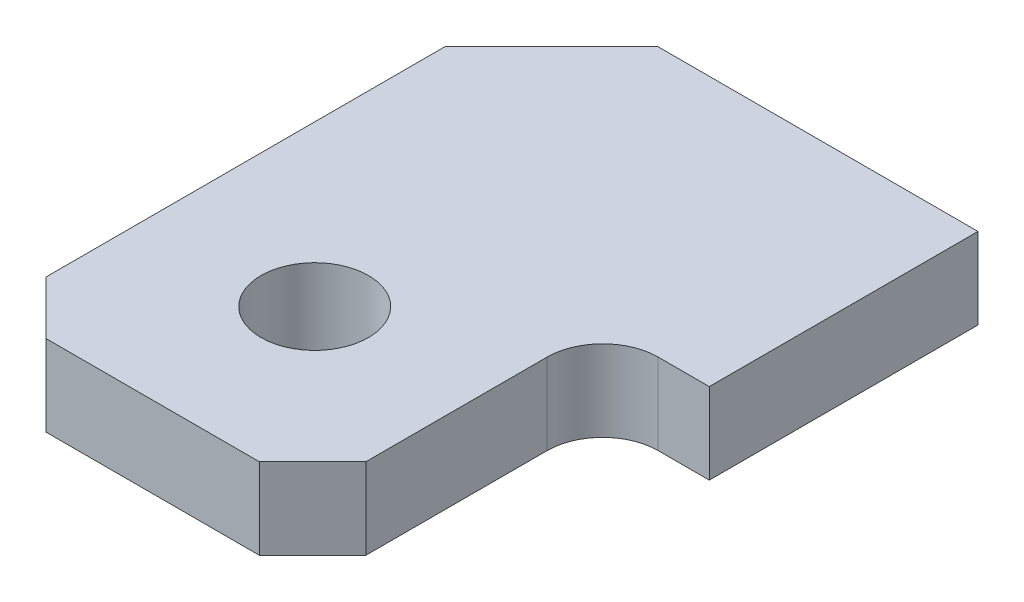
ISO-10303-21;
HEADER;
FILE_DESCRIPTION(('STEP AP214'),'2;1');
FILE_NAME('part.step','',(''),(''),'','','');
FILE_SCHEMA(('AUTOMOTIVE_DESIGN { 1 0 10303 214 1 1 1 1 }'));
ENDSEC;
DATA;
#1=APPLICATION_CONTEXT('core data for automotive mechanical design processes');
#2=APPLICATION_PROTOCOL_DEFINITION('international standard','automotive_design',2000,#1);
#3=PRODUCT_CONTEXT('',#1,'mechanical');
#4=PRODUCT('Part','Part','',(#3));
#5=PRODUCT_RELATED_PRODUCT_CATEGORY('part','',(#4));
#6=PRODUCT_DEFINITION_FORMATION('','',#4);
#7=PRODUCT_DEFINITION_CONTEXT('part definition',#1,'design');
#8=PRODUCT_DEFINITION('design','',#6,#7);
#9=PRODUCT_DEFINITION_SHAPE('','',#8);
#10=(LENGTH_UNIT() NAMED_UNIT(*) SI_UNIT(.MILLI.,.METRE.));
#11=(NAMED_UNIT(*) PLANE_ANGLE_UNIT() SI_UNIT($,.RADIAN.));
#12=(NAMED_UNIT(*) SI_UNIT($,.STERADIAN.) SOLID_ANGLE_UNIT());
#13=UNCERTAINTY_MEASURE_WITH_UNIT(LENGTH_MEASURE(1.E-05),#10,'distance_accuracy_value','');
#14=(GEOMETRIC_REPRESENTATION_CONTEXT(3) GLOBAL_UNCERTAINTY_ASSIGNED_CONTEXT((#13)) GLOBAL_UNIT_ASSIGNED_CONTEXT((#10,
#11,#12)) REPRESENTATION_CONTEXT('',''));
#15=CARTESIAN_POINT('',(0.,0.,0.));
#16=DIRECTION('',(0.,0.,1.));
#17=DIRECTION('',(1.,0.,0.));
#18=AXIS2_PLACEMENT_3D('',#15,#16,#17);
#19=CARTESIAN_POINT('',(-12.7,-4.826,-16.637));
#20=DIRECTION('',(0.,-1.,0.));
#21=DIRECTION('',(0.,0.,-1.));
#22=AXIS2_PLACEMENT_3D('',#19,#20,#21);
#23=PLANE('',#22);
#24=DIRECTION('',(-1.,0.,0.));
#25=VECTOR('',#24,1.);
#26=CARTESIAN_POINT('',(12.7,-4.826,16.637));
#27=LINE('',#26,#25);
#28=CARTESIAN_POINT('',(3.175,-4.826,16.637));
#29=VERTEX_POINT('',#28);
#30=CARTESIAN_POINT('',(-9.525,-4.826,16.637));
#31=VERTEX_POINT('',#30);
#32=EDGE_CURVE('E329',#29,#31,#27,.T.);
#33=ORIENTED_EDGE('',*,*,#32,.T.);
#34=DIRECTION('',(-0.707106781186548,0.,-0.707106781186548));
#35=VECTOR('',#34,1.);
#36=CARTESIAN_POINT('',(-12.7,-4.826,13.462));
#37=LINE('',#36,#35);
#38=CARTESIAN_POINT('',(-12.7,-4.826,13.462));
#39=VERTEX_POINT('',#38);
#40=EDGE_CURVE('E325',#31,#39,#37,.T.);
#41=ORIENTED_EDGE('',*,*,#40,.T.);
#42=DIRECTION('',(0.,0.,-1.));
#43=VECTOR('',#42,1.);
#44=CARTESIAN_POINT('',(-12.7,-4.826,16.637));
#45=LINE('',#44,#43);
#46=CARTESIAN_POINT('',(-12.7,-4.826,-10.287));
#47=VERTEX_POINT('',#46);
#48=EDGE_CURVE('E320',#39,#47,#45,.T.);
#49=ORIENTED_EDGE('',*,*,#48,.T.);
#50=DIRECTION('',(0.707106781186548,0.,-0.707106781186548));
#51=VECTOR('',#50,1.);
#52=CARTESIAN_POINT('',(-6.35,-4.826,-16.637));
#53=LINE('',#52,#51);
#54=CARTESIAN_POINT('',(-6.35,-4.826,-16.637));
#55=VERTEX_POINT('',#54);
#56=EDGE_CURVE('E147',#47,#55,#53,.T.);
#57=ORIENTED_EDGE('',*,*,#56,.T.);
#58=DIRECTION('',(1.,0.,0.));
#59=VECTOR('',#58,1.);
#60=CARTESIAN_POINT('',(-12.7,-4.826,-16.637));
#61=LINE('',#60,#59);
#62=CARTESIAN_POINT('',(12.7,-4.826,-16.637));
#63=VERTEX_POINT('',#62);
#64=EDGE_CURVE('E155',#55,#63,#61,.T.);
#65=ORIENTED_EDGE('',*,*,#64,.T.);
#66=DIRECTION('',(0.,0.,1.));
#67=VECTOR('',#66,1.);
#68=CARTESIAN_POINT('',(12.7,-4.826,-16.637));
#69=LINE('',#68,#67);
#70=CARTESIAN_POINT('',(12.7,-4.826,-0.635));
#71=VERTEX_POINT('',#70);
#72=EDGE_CURVE('E134',#63,#71,#69,.T.);
#73=ORIENTED_EDGE('',*,*,#72,.T.);
#74=DIRECTION('',(-1.,0.,0.));
#75=VECTOR('',#74,1.);
#76=CARTESIAN_POINT('',(6.35,-4.826,-0.635));
#77=LINE('',#76,#75);
#78=CARTESIAN_POINT('',(9.652,-4.826,-0.635000000000001));
#79=VERTEX_POINT('',#78);
#80=EDGE_CURVE('E91',#71,#79,#77,.T.);
#81=ORIENTED_EDGE('',*,*,#80,.T.);
#82=CARTESIAN_POINT('',(9.652,-4.826,2.667));
#83=DIRECTION('',(0.,-1.,0.));
#84=DIRECTION('',(0.,0.,-1.));
#85=AXIS2_PLACEMENT_3D('',#82,#83,#84);
#86=CIRCLE('',#85,3.302);
#87=CARTESIAN_POINT('',(6.35,-4.826,2.667));
#88=VERTEX_POINT('',#87);
#89=EDGE_CURVE('E93',#79,#88,#86,.F.);
#90=ORIENTED_EDGE('',*,*,#89,.T.);
#91=DIRECTION('',(0.,0.,1.));
#92=VECTOR('',#91,1.);
#93=CARTESIAN_POINT('',(6.35,-4.826,21.7241363353293));
#94=LINE('',#93,#92);
#95=CARTESIAN_POINT('',(6.35,-4.826,13.462));
#96=VERTEX_POINT('',#95);
#97=EDGE_CURVE('E96',#88,#96,#94,.T.);
#98=ORIENTED_EDGE('',*,*,#97,.T.);
#99=DIRECTION('',(-0.707106781186548,0.,0.707106781186548));
#100=VECTOR('',#99,1.);
#101=CARTESIAN_POINT('',(3.175,-4.826,16.637));
#102=LINE('',#101,#100);
#103=EDGE_CURVE('E127',#96,#29,#102,.T.);
#104=ORIENTED_EDGE('',*,*,#103,.T.);
#105=EDGE_LOOP('',(#33,#41,#49,#57,#65,#73,#81,#90,#98,#104));
#106=FACE_BOUND('',#105,.T.);
#107=CARTESIAN_POINT('',(-3.175,-4.826,6.985));
#108=DIRECTION('',(0.,1.,0.));
#109=DIRECTION('',(0.,0.,1.));
#110=AXIS2_PLACEMENT_3D('',#107,#108,#109);
#111=CIRCLE('',#110,3.2004);
#112=CARTESIAN_POINT('',(-3.175,-4.826,10.1854));
#113=VERTEX_POINT('',#112);
#114=EDGE_CURVE('E20',#113,#113,#111,.T.);
#115=ORIENTED_EDGE('',*,*,#114,.T.);
#116=EDGE_LOOP('',(#115));
#117=FACE_BOUND('',#116,.T.);
#118=ADVANCED_FACE('F17',(#106,#117),#23,.T.);
#119=CARTESIAN_POINT('',(-3.175,37.311979923105,6.985));
#120=DIRECTION('',(0.,1.,0.));
#121=DIRECTION('',(0.,0.,1.));
#122=AXIS2_PLACEMENT_3D('',#119,#120,#121);
#123=CYLINDRICAL_SURFACE('',#122,3.2004);
#124=ORIENTED_EDGE('',*,*,#114,.F.);
#125=EDGE_LOOP('',(#124));
#126=FACE_BOUND('',#125,.T.);
#127=CARTESIAN_POINT('',(-3.175,0.,6.985));
#128=DIRECTION('',(0.,1.,0.));
#129=DIRECTION('',(0.,0.,1.));
#130=AXIS2_PLACEMENT_3D('',#127,#128,#129);
#131=CIRCLE('',#130,3.2004);
#132=CARTESIAN_POINT('',(-3.175,0.,10.1854));
#133=VERTEX_POINT('',#132);
#134=EDGE_CURVE('E141',#133,#133,#131,.T.);
#135=ORIENTED_EDGE('',*,*,#134,.T.);
#136=EDGE_LOOP('',(#135));
#137=FACE_BOUND('',#136,.T.);
#138=ADVANCED_FACE('F172',(#126,#137),#123,.F.);
#139=CARTESIAN_POINT('',(12.7,-4.826,-16.637));
#140=DIRECTION('',(-1.,0.,0.));
#141=DIRECTION('',(0.,0.,1.));
#142=AXIS2_PLACEMENT_3D('',#139,#140,#141);
#143=PLANE('',#142);
#144=DIRECTION('',(0.,1.,0.));
#145=VECTOR('',#144,1.);
#146=CARTESIAN_POINT('',(12.7,103.124,-0.635000000000001));
#147=LINE('',#146,#145);
#148=CARTESIAN_POINT('',(12.7,0.,-0.635));
#149=VERTEX_POINT('',#148);
#150=EDGE_CURVE('E131',#149,#71,#147,.F.);
#151=ORIENTED_EDGE('',*,*,#150,.T.);
#152=ORIENTED_EDGE('',*,*,#72,.F.);
#153=DIRECTION('',(0.,1.,0.));
#154=VECTOR('',#153,1.);
#155=CARTESIAN_POINT('',(12.7,-4.826,-16.637));
#156=LINE('',#155,#154);
#157=CARTESIAN_POINT('',(12.7,0.,-16.637));
#158=VERTEX_POINT('',#157);
#159=EDGE_CURVE('E144',#63,#158,#156,.T.);
#160=ORIENTED_EDGE('',*,*,#159,.T.);
#161=DIRECTION('',(0.,0.,-1.));
#162=VECTOR('',#161,1.);
#163=CARTESIAN_POINT('',(12.7,0.,-16.637));
#164=LINE('',#163,#162);
#165=EDGE_CURVE('E137',#158,#149,#164,.F.);
#166=ORIENTED_EDGE('',*,*,#165,.T.);
#167=EDGE_LOOP('',(#151,#152,#160,#166));
#168=FACE_BOUND('',#167,.T.);
#169=ADVANCED_FACE('F213',(#168),#143,.F.);
#170=CARTESIAN_POINT('',(6.35,103.124,-0.635));
#171=DIRECTION('',(0.,0.,-1.));
#172=DIRECTION('',(-1.,0.,0.));
#173=AXIS2_PLACEMENT_3D('',#170,#171,#172);
#174=PLANE('',#173);
#175=DIRECTION('',(0.,-1.,0.));
#176=VECTOR('',#175,1.);
#177=CARTESIAN_POINT('',(9.652,103.124,-0.635000000000001));
#178=LINE('',#177,#176);
#179=CARTESIAN_POINT('',(9.652,0.,-0.635));
#180=VERTEX_POINT('',#179);
#181=EDGE_CURVE('E102',#180,#79,#178,.T.);
#182=ORIENTED_EDGE('',*,*,#181,.T.);
#183=ORIENTED_EDGE('',*,*,#80,.F.);
#184=ORIENTED_EDGE('',*,*,#150,.F.);
#185=DIRECTION('',(1.,0.,0.));
#186=VECTOR('',#185,1.);
#187=CARTESIAN_POINT('',(-12.7,0.,-0.635));
#188=LINE('',#187,#186);
#189=EDGE_CURVE('E140',#149,#180,#188,.F.);
#190=ORIENTED_EDGE('',*,*,#189,.T.);
#191=EDGE_LOOP('',(#182,#183,#184,#190));
#192=FACE_BOUND('',#191,.T.);
#193=ADVANCED_FACE('F210',(#192),#174,.F.);
#194=CARTESIAN_POINT('',(9.652,103.124,2.667));
#195=DIRECTION('',(0.,-1.,0.));
#196=DIRECTION('',(0.,0.,-1.));
#197=AXIS2_PLACEMENT_3D('',#194,#195,#196);
#198=CYLINDRICAL_SURFACE('',#197,3.302);
#199=DIRECTION('',(0.,1.,0.));
#200=VECTOR('',#199,1.);
#201=CARTESIAN_POINT('',(6.35,103.124,2.667));
#202=LINE('',#201,#200);
#203=CARTESIAN_POINT('',(6.35,0.,2.667));
#204=VERTEX_POINT('',#203);
#205=EDGE_CURVE('E101',#204,#88,#202,.F.);
#206=ORIENTED_EDGE('',*,*,#205,.T.);
#207=ORIENTED_EDGE('',*,*,#89,.F.);
#208=ORIENTED_EDGE('',*,*,#181,.F.);
#209=CARTESIAN_POINT('',(9.652,0.,2.667));
#210=DIRECTION('',(0.,-1.,0.));
#211=DIRECTION('',(0.,0.,-1.));
#212=AXIS2_PLACEMENT_3D('',#209,#210,#211);
#213=CIRCLE('',#212,3.302);
#214=EDGE_CURVE('E113',#180,#204,#213,.F.);
#215=ORIENTED_EDGE('',*,*,#214,.T.);
#216=EDGE_LOOP('',(#206,#207,#208,#215));
#217=FACE_BOUND('',#216,.T.);
#218=ADVANCED_FACE('F111',(#217),#198,.F.);
#219=CARTESIAN_POINT('',(6.35,103.124,21.7241363353293));
#220=DIRECTION('',(-1.,0.,0.));
#221=DIRECTION('',(0.,0.,1.));
#222=AXIS2_PLACEMENT_3D('',#219,#220,#221);
#223=PLANE('',#222);
#224=ORIENTED_EDGE('',*,*,#205,.F.);
#225=DIRECTION('',(0.,0.,-1.));
#226=VECTOR('',#225,1.);
#227=CARTESIAN_POINT('',(6.35,0.,-16.637));
#228=LINE('',#227,#226);
#229=CARTESIAN_POINT('',(6.35,0.,13.462));
#230=VERTEX_POINT('',#229);
#231=EDGE_CURVE('E123',#204,#230,#228,.F.);
#232=ORIENTED_EDGE('',*,*,#231,.T.);
#233=DIRECTION('',(0.,1.,0.));
#234=VECTOR('',#233,1.);
#235=CARTESIAN_POINT('',(6.35,-4.826,13.462));
#236=LINE('',#235,#234);
#237=EDGE_CURVE('E108',#230,#96,#236,.F.);
#238=ORIENTED_EDGE('',*,*,#237,.T.);
#239=ORIENTED_EDGE('',*,*,#97,.F.);
#240=EDGE_LOOP('',(#224,#232,#238,#239));
#241=FACE_BOUND('',#240,.T.);
#242=ADVANCED_FACE('F105',(#241),#223,.F.);
#243=CARTESIAN_POINT('',(3.175,-4.826,16.637));
#244=DIRECTION('',(-0.707106781186548,0.,-0.707106781186548));
#245=DIRECTION('',(-0.707106781186548,0.,0.707106781186548));
#246=AXIS2_PLACEMENT_3D('',#243,#244,#245);
#247=PLANE('',#246);
#248=ORIENTED_EDGE('',*,*,#237,.F.);
#249=DIRECTION('',(-0.707106781186547,0.,0.707106781186548));
#250=VECTOR('',#249,1.);
#251=CARTESIAN_POINT('',(6.35,0.,13.462));
#252=LINE('',#251,#250);
#253=CARTESIAN_POINT('',(3.175,0.,16.637));
#254=VERTEX_POINT('',#253);
#255=EDGE_CURVE('E119',#230,#254,#252,.T.);
#256=ORIENTED_EDGE('',*,*,#255,.T.);
#257=DIRECTION('',(0.,1.,0.));
#258=VECTOR('',#257,1.);
#259=CARTESIAN_POINT('',(3.175,-4.826,16.637));
#260=LINE('',#259,#258);
#261=EDGE_CURVE('E117',#254,#29,#260,.F.);
#262=ORIENTED_EDGE('',*,*,#261,.T.);
#263=ORIENTED_EDGE('',*,*,#103,.F.);
#264=EDGE_LOOP('',(#248,#256,#262,#263));
#265=FACE_BOUND('',#264,.T.);
#266=ADVANCED_FACE('F201',(#265),#247,.F.);
#267=CARTESIAN_POINT('',(12.7,-4.826,16.637));
#268=DIRECTION('',(0.,0.,-1.));
#269=DIRECTION('',(-1.,0.,0.));
#270=AXIS2_PLACEMENT_3D('',#267,#268,#269);
#271=PLANE('',#270);
#272=DIRECTION('',(0.,1.,0.));
#273=VECTOR('',#272,1.);
#274=CARTESIAN_POINT('',(-9.525,-4.826,16.637));
#275=LINE('',#274,#273);
#276=CARTESIAN_POINT('',(-9.525,0.,16.637));
#277=VERTEX_POINT('',#276);
#278=EDGE_CURVE('E327',#277,#31,#275,.F.);
#279=ORIENTED_EDGE('',*,*,#278,.T.);
#280=ORIENTED_EDGE('',*,*,#32,.F.);
#281=ORIENTED_EDGE('',*,*,#261,.F.);
#282=DIRECTION('',(1.,0.,0.));
#283=VECTOR('',#282,1.);
#284=CARTESIAN_POINT('',(-12.7,0.,16.637));
#285=LINE('',#284,#283);
#286=EDGE_CURVE('E122',#254,#277,#285,.F.);
#287=ORIENTED_EDGE('',*,*,#286,.T.);
#288=EDGE_LOOP('',(#279,#280,#281,#287));
#289=FACE_BOUND('',#288,.T.);
#290=ADVANCED_FACE('F197',(#289),#271,.F.);
#291=CARTESIAN_POINT('',(-12.7,-4.826,13.462));
#292=DIRECTION('',(0.707106781186548,0.,-0.707106781186548));
#293=DIRECTION('',(-0.707106781186548,0.,-0.707106781186548));
#294=AXIS2_PLACEMENT_3D('',#291,#292,#293);
#295=PLANE('',#294);
#296=ORIENTED_EDGE('',*,*,#278,.F.);
#297=DIRECTION('',(-0.707106781186547,0.,-0.707106781186548));
#298=VECTOR('',#297,1.);
#299=CARTESIAN_POINT('',(-9.525,0.,16.637));
#300=LINE('',#299,#298);
#301=CARTESIAN_POINT('',(-12.7,0.,13.462));
#302=VERTEX_POINT('',#301);
#303=EDGE_CURVE('E339',#277,#302,#300,.T.);
#304=ORIENTED_EDGE('',*,*,#303,.T.);
#305=DIRECTION('',(0.,1.,0.));
#306=VECTOR('',#305,1.);
#307=CARTESIAN_POINT('',(-12.7,-4.826,13.462));
#308=LINE('',#307,#306);
#309=EDGE_CURVE('E322',#302,#39,#308,.F.);
#310=ORIENTED_EDGE('',*,*,#309,.T.);
#311=ORIENTED_EDGE('',*,*,#40,.F.);
#312=EDGE_LOOP('',(#296,#304,#310,#311));
#313=FACE_BOUND('',#312,.T.);
#314=ADVANCED_FACE('F193',(#313),#295,.F.);
#315=CARTESIAN_POINT('',(-12.7,-4.826,16.637));
#316=DIRECTION('',(1.,0.,0.));
#317=DIRECTION('',(0.,0.,-1.));
#318=AXIS2_PLACEMENT_3D('',#315,#316,#317);
#319=PLANE('',#318);
#320=DIRECTION('',(0.,1.,0.));
#321=VECTOR('',#320,1.);
#322=CARTESIAN_POINT('',(-12.7,-4.826,-10.287));
#323=LINE('',#322,#321);
#324=CARTESIAN_POINT('',(-12.7,0.,-10.287));
#325=VERTEX_POINT('',#324);
#326=EDGE_CURVE('E317',#325,#47,#323,.F.);
#327=ORIENTED_EDGE('',*,*,#326,.T.);
#328=ORIENTED_EDGE('',*,*,#48,.F.);
#329=ORIENTED_EDGE('',*,*,#309,.F.);
#330=DIRECTION('',(0.,0.,-1.));
#331=VECTOR('',#330,1.);
#332=CARTESIAN_POINT('',(-12.7,0.,-16.637));
#333=LINE('',#332,#331);
#334=EDGE_CURVE('E341',#302,#325,#333,.T.);
#335=ORIENTED_EDGE('',*,*,#334,.T.);
#336=EDGE_LOOP('',(#327,#328,#329,#335));
#337=FACE_BOUND('',#336,.T.);
#338=ADVANCED_FACE('F189',(#337),#319,.F.);
#339=CARTESIAN_POINT('',(-6.35,-4.826,-16.637));
#340=DIRECTION('',(0.707106781186548,0.,0.707106781186548));
#341=DIRECTION('',(0.707106781186548,0.,-0.707106781186548));
#342=AXIS2_PLACEMENT_3D('',#339,#340,#341);
#343=PLANE('',#342);
#344=ORIENTED_EDGE('',*,*,#326,.F.);
#345=DIRECTION('',(0.707106781186547,0.,-0.707106781186548));
#346=VECTOR('',#345,1.);
#347=CARTESIAN_POINT('',(-12.7,0.,-10.287));
#348=LINE('',#347,#346);
#349=CARTESIAN_POINT('',(-6.35,0.,-16.637));
#350=VERTEX_POINT('',#349);
#351=EDGE_CURVE('E26',#325,#350,#348,.T.);
#352=ORIENTED_EDGE('',*,*,#351,.T.);
#353=DIRECTION('',(0.,1.,0.));
#354=VECTOR('',#353,1.);
#355=CARTESIAN_POINT('',(-6.35,-4.826,-16.637));
#356=LINE('',#355,#354);
#357=EDGE_CURVE('E34',#350,#55,#356,.F.);
#358=ORIENTED_EDGE('',*,*,#357,.T.);
#359=ORIENTED_EDGE('',*,*,#56,.F.);
#360=EDGE_LOOP('',(#344,#352,#358,#359));
#361=FACE_BOUND('',#360,.T.);
#362=ADVANCED_FACE('F183',(#361),#343,.F.);
#363=CARTESIAN_POINT('',(-12.7,-4.826,-16.637));
#364=DIRECTION('',(0.,0.,1.));
#365=DIRECTION('',(1.,0.,0.));
#366=AXIS2_PLACEMENT_3D('',#363,#364,#365);
#367=PLANE('',#366);
#368=ORIENTED_EDGE('',*,*,#357,.F.);
#369=DIRECTION('',(1.,0.,0.));
#370=VECTOR('',#369,1.);
#371=CARTESIAN_POINT('',(-12.7,0.,-16.637));
#372=LINE('',#371,#370);
#373=EDGE_CURVE('E11',#350,#158,#372,.T.);
#374=ORIENTED_EDGE('',*,*,#373,.T.);
#375=ORIENTED_EDGE('',*,*,#159,.F.);
#376=ORIENTED_EDGE('',*,*,#64,.F.);
#377=EDGE_LOOP('',(#368,#374,#375,#376));
#378=FACE_BOUND('',#377,.T.);
#379=ADVANCED_FACE('F176',(#378),#367,.F.);
#380=CARTESIAN_POINT('',(-12.7,0.,-16.637));
#381=DIRECTION('',(0.,-1.,0.));
#382=DIRECTION('',(0.,0.,-1.));
#383=AXIS2_PLACEMENT_3D('',#380,#381,#382);
#384=PLANE('',#383);
#385=ORIENTED_EDGE('',*,*,#351,.F.);
#386=ORIENTED_EDGE('',*,*,#334,.F.);
#387=ORIENTED_EDGE('',*,*,#303,.F.);
#388=ORIENTED_EDGE('',*,*,#286,.F.);
#389=ORIENTED_EDGE('',*,*,#255,.F.);
#390=ORIENTED_EDGE('',*,*,#231,.F.);
#391=ORIENTED_EDGE('',*,*,#214,.F.);
#392=ORIENTED_EDGE('',*,*,#189,.F.);
#393=ORIENTED_EDGE('',*,*,#165,.F.);
#394=ORIENTED_EDGE('',*,*,#373,.F.);
#395=EDGE_LOOP('',(#385,#386,#387,#388,#389,#390,#391,#392,#393,#394));
#396=FACE_BOUND('',#395,.T.);
#397=ORIENTED_EDGE('',*,*,#134,.F.);
#398=EDGE_LOOP('',(#397));
#399=FACE_BOUND('',#398,.T.);
#400=ADVANCED_FACE('F174',(#396,#399),#384,.F.);
#401=CLOSED_SHELL('',(#118,#138,#169,#193,#218,#242,#266,#290,#314,#338,#362,#379,#400));
#402=MANIFOLD_SOLID_BREP('B1',#401);
#403=ADVANCED_BREP_SHAPE_REPRESENTATION('',(#18,#402),#14);
#404=SHAPE_DEFINITION_REPRESENTATION(#9,#403);
ENDSEC;
END-ISO-10303-21;
